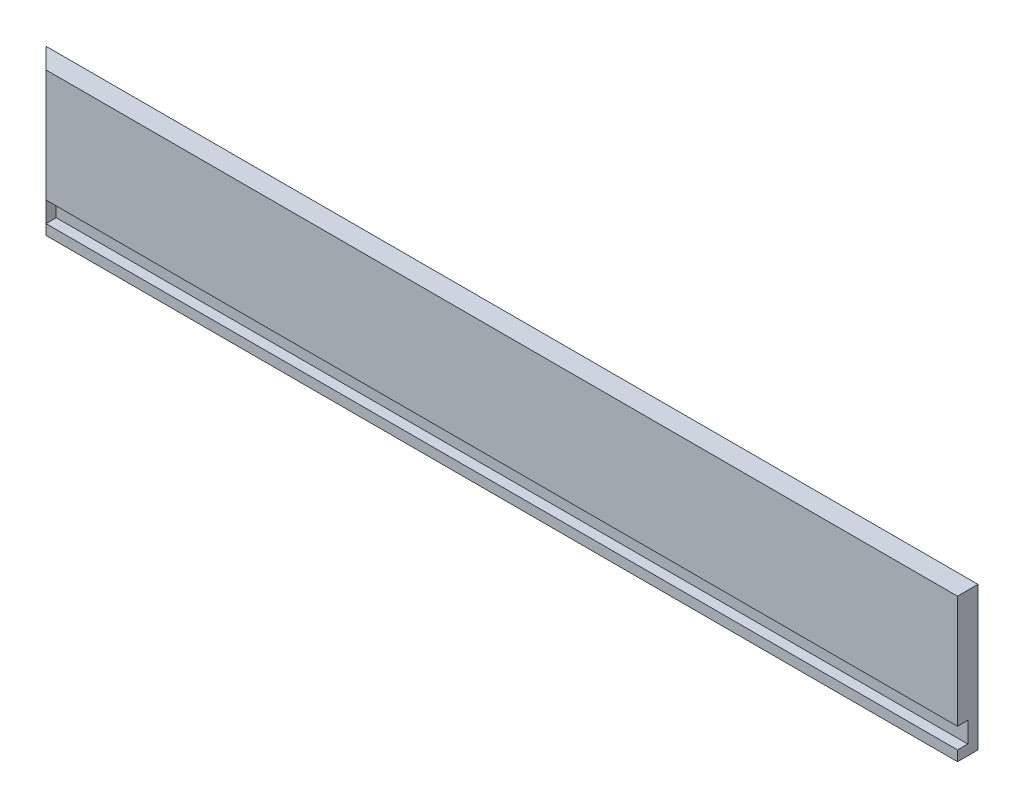
ISO-10303-21;
HEADER;
FILE_DESCRIPTION(('STEP AP214'),'2;1');
FILE_NAME('part.step','',(''),(''),'','','');
FILE_SCHEMA(('AUTOMOTIVE_DESIGN { 1 0 10303 214 1 1 1 1 }'));
ENDSEC;
DATA;
#1=APPLICATION_CONTEXT('core data for automotive mechanical design processes');
#2=APPLICATION_PROTOCOL_DEFINITION('international standard','automotive_design',2000,#1);
#3=PRODUCT_CONTEXT('',#1,'mechanical');
#4=PRODUCT('Part','Part','',(#3));
#5=PRODUCT_RELATED_PRODUCT_CATEGORY('part','',(#4));
#6=PRODUCT_DEFINITION_FORMATION('','',#4);
#7=PRODUCT_DEFINITION_CONTEXT('part definition',#1,'design');
#8=PRODUCT_DEFINITION('design','',#6,#7);
#9=PRODUCT_DEFINITION_SHAPE('','',#8);
#10=(LENGTH_UNIT() NAMED_UNIT(*) SI_UNIT(.MILLI.,.METRE.));
#11=(NAMED_UNIT(*) PLANE_ANGLE_UNIT() SI_UNIT($,.RADIAN.));
#12=(NAMED_UNIT(*) SI_UNIT($,.STERADIAN.) SOLID_ANGLE_UNIT());
#13=UNCERTAINTY_MEASURE_WITH_UNIT(LENGTH_MEASURE(1.E-05),#10,'distance_accuracy_value','');
#14=(GEOMETRIC_REPRESENTATION_CONTEXT(3) GLOBAL_UNCERTAINTY_ASSIGNED_CONTEXT((#13)) GLOBAL_UNIT_ASSIGNED_CONTEXT((#10,
#11,#12)) REPRESENTATION_CONTEXT('',''));
#15=CARTESIAN_POINT('',(0.,0.,0.));
#16=DIRECTION('',(0.,0.,1.));
#17=DIRECTION('',(1.,0.,0.));
#18=AXIS2_PLACEMENT_3D('',#15,#16,#17);
#19=CARTESIAN_POINT('',(0.,0.,12.7));
#20=DIRECTION('',(0.,0.,1.));
#21=DIRECTION('',(1.,0.,0.));
#22=AXIS2_PLACEMENT_3D('',#19,#20,#21);
#23=PLANE('',#22);
#24=DIRECTION('',(-1.,0.,0.));
#25=VECTOR('',#24,1.);
#26=CARTESIAN_POINT('',(-200.944003606853,49.2826420198376,12.7));
#27=LINE('',#26,#25);
#28=CARTESIAN_POINT('',(364.205996393147,49.2826420198376,12.7));
#29=VERTEX_POINT('',#28);
#30=CARTESIAN_POINT('',(-200.944003606853,49.2826420198376,12.7));
#31=VERTEX_POINT('',#30);
#32=EDGE_CURVE('E57',#29,#31,#27,.T.);
#33=ORIENTED_EDGE('',*,*,#32,.F.);
#34=DIRECTION('',(0.,1.,0.));
#35=VECTOR('',#34,1.);
#36=CARTESIAN_POINT('',(364.205996393147,119.132642019838,12.7));
#37=LINE('',#36,#35);
#38=CARTESIAN_POINT('',(364.205996393147,119.132642019838,12.7));
#39=VERTEX_POINT('',#38);
#40=EDGE_CURVE('E65',#29,#39,#37,.T.);
#41=ORIENTED_EDGE('',*,*,#40,.T.);
#42=DIRECTION('',(-1.,0.,0.));
#43=VECTOR('',#42,1.);
#44=CARTESIAN_POINT('',(-213.644003606853,119.132642019838,12.7));
#45=LINE('',#44,#43);
#46=CARTESIAN_POINT('',(-200.944003606853,119.132642019838,12.7));
#47=VERTEX_POINT('',#46);
#48=EDGE_CURVE('E122',#39,#47,#45,.T.);
#49=ORIENTED_EDGE('',*,*,#48,.T.);
#50=DIRECTION('',(0.,1.,0.));
#51=VECTOR('',#50,1.);
#52=CARTESIAN_POINT('',(-200.944003606853,30.2326420198376,12.7));
#53=LINE('',#52,#51);
#54=EDGE_CURVE('E93',#31,#47,#53,.T.);
#55=ORIENTED_EDGE('',*,*,#54,.F.);
#56=EDGE_LOOP('',(#33,#41,#49,#55));
#57=FACE_BOUND('',#56,.T.);
#58=ADVANCED_FACE('F41',(#57),#23,.T.);
#59=CARTESIAN_POINT('',(-213.644003606853,30.2326420198376,12.7));
#60=DIRECTION('',(0.,1.,0.));
#61=DIRECTION('',(0.,0.,1.));
#62=AXIS2_PLACEMENT_3D('',#59,#60,#61);
#63=PLANE('',#62);
#64=DIRECTION('',(1.,0.,0.));
#65=VECTOR('',#64,1.);
#66=CARTESIAN_POINT('',(-213.644003606853,30.2326420198376,12.7));
#67=LINE('',#66,#65);
#68=CARTESIAN_POINT('',(-200.944003606853,30.2326420198376,12.7));
#69=VERTEX_POINT('',#68);
#70=CARTESIAN_POINT('',(364.205996393147,30.2326420198376,12.7));
#71=VERTEX_POINT('',#70);
#72=EDGE_CURVE('E107',#69,#71,#67,.T.);
#73=ORIENTED_EDGE('',*,*,#72,.F.);
#74=DIRECTION('',(-0.707106781186542,0.,-0.707106781186552));
#75=VECTOR('',#74,1.);
#76=CARTESIAN_POINT('',(-200.944003606853,30.2326420198376,12.7));
#77=LINE('',#76,#75);
#78=CARTESIAN_POINT('',(-213.644003606853,30.2326420198376,0.));
#79=VERTEX_POINT('',#78);
#80=EDGE_CURVE('E97',#69,#79,#77,.T.);
#81=ORIENTED_EDGE('',*,*,#80,.T.);
#82=DIRECTION('',(1.,0.,0.));
#83=VECTOR('',#82,1.);
#84=CARTESIAN_POINT('',(-213.644003606853,30.2326420198376,0.));
#85=LINE('',#84,#83);
#86=CARTESIAN_POINT('',(364.205996393147,30.2326420198376,0.));
#87=VERTEX_POINT('',#86);
#88=EDGE_CURVE('E112',#79,#87,#85,.T.);
#89=ORIENTED_EDGE('',*,*,#88,.T.);
#90=DIRECTION('',(0.,0.,-1.));
#91=VECTOR('',#90,1.);
#92=CARTESIAN_POINT('',(364.205996393147,30.2326420198376,12.7));
#93=LINE('',#92,#91);
#94=EDGE_CURVE('E11',#71,#87,#93,.T.);
#95=ORIENTED_EDGE('',*,*,#94,.F.);
#96=EDGE_LOOP('',(#73,#81,#89,#95));
#97=FACE_BOUND('',#96,.T.);
#98=ADVANCED_FACE('F43',(#97),#63,.F.);
#99=CARTESIAN_POINT('',(364.205996393147,119.132642019838,12.7));
#100=DIRECTION('',(-1.,0.,0.));
#101=DIRECTION('',(0.,0.,1.));
#102=AXIS2_PLACEMENT_3D('',#99,#100,#101);
#103=PLANE('',#102);
#104=ORIENTED_EDGE('',*,*,#40,.F.);
#105=DIRECTION('',(0.,0.,1.));
#106=VECTOR('',#105,1.);
#107=CARTESIAN_POINT('',(364.205996393147,49.2826420198376,6.35));
#108=LINE('',#107,#106);
#109=CARTESIAN_POINT('',(364.205996393147,49.2826420198376,6.35));
#110=VERTEX_POINT('',#109);
#111=EDGE_CURVE('E150',#110,#29,#108,.T.);
#112=ORIENTED_EDGE('',*,*,#111,.F.);
#113=DIRECTION('',(0.,1.,0.));
#114=VECTOR('',#113,1.);
#115=CARTESIAN_POINT('',(364.205996393147,49.2826420198376,6.35));
#116=LINE('',#115,#114);
#117=CARTESIAN_POINT('',(364.205996393147,36.5826420198376,6.35));
#118=VERTEX_POINT('',#117);
#119=EDGE_CURVE('E169',#118,#110,#116,.T.);
#120=ORIENTED_EDGE('',*,*,#119,.F.);
#121=DIRECTION('',(0.,0.,1.));
#122=VECTOR('',#121,1.);
#123=CARTESIAN_POINT('',(364.205996393147,36.5826420198376,6.35));
#124=LINE('',#123,#122);
#125=CARTESIAN_POINT('',(364.205996393147,36.5826420198376,12.7));
#126=VERTEX_POINT('',#125);
#127=EDGE_CURVE('E145',#118,#126,#124,.T.);
#128=ORIENTED_EDGE('',*,*,#127,.T.);
#129=EDGE_CURVE('E128',#71,#126,#37,.T.);
#130=ORIENTED_EDGE('',*,*,#129,.F.);
#131=ORIENTED_EDGE('',*,*,#94,.T.);
#132=DIRECTION('',(0.,1.,0.));
#133=VECTOR('',#132,1.);
#134=CARTESIAN_POINT('',(364.205996393147,119.132642019838,0.));
#135=LINE('',#134,#133);
#136=CARTESIAN_POINT('',(364.205996393147,119.132642019838,0.));
#137=VERTEX_POINT('',#136);
#138=EDGE_CURVE('E108',#87,#137,#135,.T.);
#139=ORIENTED_EDGE('',*,*,#138,.T.);
#140=DIRECTION('',(0.,0.,-1.));
#141=VECTOR('',#140,1.);
#142=CARTESIAN_POINT('',(364.205996393147,119.132642019838,12.7));
#143=LINE('',#142,#141);
#144=EDGE_CURVE('E50',#39,#137,#143,.T.);
#145=ORIENTED_EDGE('',*,*,#144,.F.);
#146=EDGE_LOOP('',(#104,#112,#120,#128,#130,#131,#139,#145));
#147=FACE_BOUND('',#146,.T.);
#148=ADVANCED_FACE('F210',(#147),#103,.F.);
#149=CARTESIAN_POINT('',(-213.644003606853,119.132642019838,12.7));
#150=DIRECTION('',(0.,-1.,0.));
#151=DIRECTION('',(0.,0.,-1.));
#152=AXIS2_PLACEMENT_3D('',#149,#150,#151);
#153=PLANE('',#152);
#154=DIRECTION('',(-1.,0.,0.));
#155=VECTOR('',#154,1.);
#156=CARTESIAN_POINT('',(-213.644003606853,119.132642019838,0.));
#157=LINE('',#156,#155);
#158=CARTESIAN_POINT('',(-213.644003606853,119.132642019838,0.));
#159=VERTEX_POINT('',#158);
#160=EDGE_CURVE('E102',#137,#159,#157,.T.);
#161=ORIENTED_EDGE('',*,*,#160,.T.);
#162=DIRECTION('',(-0.707106781186542,0.,-0.707106781186552));
#163=VECTOR('',#162,1.);
#164=CARTESIAN_POINT('',(-200.944003606853,119.132642019838,12.7));
#165=LINE('',#164,#163);
#166=EDGE_CURVE('E83',#47,#159,#165,.T.);
#167=ORIENTED_EDGE('',*,*,#166,.F.);
#168=ORIENTED_EDGE('',*,*,#48,.F.);
#169=ORIENTED_EDGE('',*,*,#144,.T.);
#170=EDGE_LOOP('',(#161,#167,#168,#169));
#171=FACE_BOUND('',#170,.T.);
#172=ADVANCED_FACE('F103',(#171),#153,.F.);
#173=DIRECTION('',(1.,0.,0.));
#174=VECTOR('',#173,1.);
#175=CARTESIAN_POINT('',(-200.944003606853,36.5826420198376,12.7));
#176=LINE('',#175,#174);
#177=CARTESIAN_POINT('',(-200.944003606853,36.5826420198376,12.7));
#178=VERTEX_POINT('',#177);
#179=EDGE_CURVE('E158',#178,#126,#176,.T.);
#180=ORIENTED_EDGE('',*,*,#179,.F.);
#181=EDGE_CURVE('E114',#69,#178,#53,.T.);
#182=ORIENTED_EDGE('',*,*,#181,.F.);
#183=ORIENTED_EDGE('',*,*,#72,.T.);
#184=ORIENTED_EDGE('',*,*,#129,.T.);
#185=EDGE_LOOP('',(#180,#182,#183,#184));
#186=FACE_BOUND('',#185,.T.);
#187=ADVANCED_FACE('F207',(#186),#23,.T.);
#188=CARTESIAN_POINT('',(0.,0.,0.));
#189=DIRECTION('',(0.,0.,1.));
#190=DIRECTION('',(1.,0.,0.));
#191=AXIS2_PLACEMENT_3D('',#188,#189,#190);
#192=PLANE('',#191);
#193=DIRECTION('',(0.,-1.,0.));
#194=VECTOR('',#193,1.);
#195=CARTESIAN_POINT('',(-213.644003606853,119.132642019838,0.));
#196=LINE('',#195,#194);
#197=EDGE_CURVE('E88',#159,#79,#196,.T.);
#198=ORIENTED_EDGE('',*,*,#197,.F.);
#199=ORIENTED_EDGE('',*,*,#160,.F.);
#200=ORIENTED_EDGE('',*,*,#138,.F.);
#201=ORIENTED_EDGE('',*,*,#88,.F.);
#202=EDGE_LOOP('',(#198,#199,#200,#201));
#203=FACE_BOUND('',#202,.T.);
#204=ADVANCED_FACE('F111',(#203),#192,.F.);
#205=CARTESIAN_POINT('',(-200.944003606853,30.2326420198376,12.7));
#206=DIRECTION('',(0.707106781186552,0.,-0.707106781186543));
#207=DIRECTION('',(-0.707106781186543,0.,-0.707106781186552));
#208=AXIS2_PLACEMENT_3D('',#205,#206,#207);
#209=PLANE('',#208);
#210=ORIENTED_EDGE('',*,*,#166,.T.);
#211=ORIENTED_EDGE('',*,*,#197,.T.);
#212=ORIENTED_EDGE('',*,*,#80,.F.);
#213=ORIENTED_EDGE('',*,*,#181,.T.);
#214=DIRECTION('',(0.,-1.,0.));
#215=VECTOR('',#214,1.);
#216=CARTESIAN_POINT('',(-200.944003606853,49.2826420198376,12.7));
#217=LINE('',#216,#215);
#218=EDGE_CURVE('E162',#31,#178,#217,.T.);
#219=ORIENTED_EDGE('',*,*,#218,.F.);
#220=ORIENTED_EDGE('',*,*,#54,.T.);
#221=EDGE_LOOP('',(#210,#211,#212,#213,#219,#220));
#222=FACE_BOUND('',#221,.T.);
#223=ADVANCED_FACE('F85',(#222),#209,.F.);
#224=CARTESIAN_POINT('',(-200.944003606853,49.2826420198376,6.35));
#225=DIRECTION('',(-1.,0.,0.));
#226=DIRECTION('',(0.,0.,1.));
#227=AXIS2_PLACEMENT_3D('',#224,#225,#226);
#228=PLANE('',#227);
#229=ORIENTED_EDGE('',*,*,#218,.T.);
#230=DIRECTION('',(0.,0.,1.));
#231=VECTOR('',#230,1.);
#232=CARTESIAN_POINT('',(-200.944003606853,36.5826420198376,6.35));
#233=LINE('',#232,#231);
#234=CARTESIAN_POINT('',(-200.944003606853,36.5826420198376,6.35));
#235=VERTEX_POINT('',#234);
#236=EDGE_CURVE('E141',#235,#178,#233,.T.);
#237=ORIENTED_EDGE('',*,*,#236,.F.);
#238=DIRECTION('',(0.,-1.,0.));
#239=VECTOR('',#238,1.);
#240=CARTESIAN_POINT('',(-200.944003606853,49.2826420198376,6.35));
#241=LINE('',#240,#239);
#242=CARTESIAN_POINT('',(-200.944003606853,49.2826420198376,6.35));
#243=VERTEX_POINT('',#242);
#244=EDGE_CURVE('E157',#243,#235,#241,.T.);
#245=ORIENTED_EDGE('',*,*,#244,.F.);
#246=DIRECTION('',(0.,0.,1.));
#247=VECTOR('',#246,1.);
#248=CARTESIAN_POINT('',(-200.944003606853,49.2826420198376,6.35));
#249=LINE('',#248,#247);
#250=EDGE_CURVE('E98',#243,#31,#249,.T.);
#251=ORIENTED_EDGE('',*,*,#250,.T.);
#252=EDGE_LOOP('',(#229,#237,#245,#251));
#253=FACE_BOUND('',#252,.T.);
#254=ADVANCED_FACE('F192',(#253),#228,.F.);
#255=CARTESIAN_POINT('',(-200.944003606853,49.2826420198376,6.35));
#256=DIRECTION('',(0.,1.,0.));
#257=DIRECTION('',(0.,0.,1.));
#258=AXIS2_PLACEMENT_3D('',#255,#256,#257);
#259=PLANE('',#258);
#260=ORIENTED_EDGE('',*,*,#32,.T.);
#261=ORIENTED_EDGE('',*,*,#250,.F.);
#262=DIRECTION('',(-1.,0.,0.));
#263=VECTOR('',#262,1.);
#264=CARTESIAN_POINT('',(-200.944003606853,49.2826420198376,6.35));
#265=LINE('',#264,#263);
#266=EDGE_CURVE('E146',#110,#243,#265,.T.);
#267=ORIENTED_EDGE('',*,*,#266,.F.);
#268=ORIENTED_EDGE('',*,*,#111,.T.);
#269=EDGE_LOOP('',(#260,#261,#267,#268));
#270=FACE_BOUND('',#269,.T.);
#271=ADVANCED_FACE('F216',(#270),#259,.F.);
#272=CARTESIAN_POINT('',(-200.944003606853,36.5826420198376,6.35));
#273=DIRECTION('',(0.,-1.,0.));
#274=DIRECTION('',(1.,0.,0.));
#275=AXIS2_PLACEMENT_3D('',#272,#273,#274);
#276=PLANE('',#275);
#277=ORIENTED_EDGE('',*,*,#179,.T.);
#278=ORIENTED_EDGE('',*,*,#127,.F.);
#279=DIRECTION('',(1.,0.,0.));
#280=VECTOR('',#279,1.);
#281=CARTESIAN_POINT('',(-200.944003606853,36.5826420198376,6.35));
#282=LINE('',#281,#280);
#283=EDGE_CURVE('E173',#235,#118,#282,.T.);
#284=ORIENTED_EDGE('',*,*,#283,.F.);
#285=ORIENTED_EDGE('',*,*,#236,.T.);
#286=EDGE_LOOP('',(#277,#278,#284,#285));
#287=FACE_BOUND('',#286,.T.);
#288=ADVANCED_FACE('F214',(#287),#276,.F.);
#289=CARTESIAN_POINT('',(0.,0.,6.35));
#290=DIRECTION('',(0.,0.,1.));
#291=DIRECTION('',(1.,0.,0.));
#292=AXIS2_PLACEMENT_3D('',#289,#290,#291);
#293=PLANE('',#292);
#294=ORIENTED_EDGE('',*,*,#244,.T.);
#295=ORIENTED_EDGE('',*,*,#283,.T.);
#296=ORIENTED_EDGE('',*,*,#119,.T.);
#297=ORIENTED_EDGE('',*,*,#266,.T.);
#298=EDGE_LOOP('',(#294,#295,#296,#297));
#299=FACE_BOUND('',#298,.T.);
#300=ADVANCED_FACE('F182',(#299),#293,.T.);
#301=CLOSED_SHELL('',(#58,#98,#148,#172,#187,#204,#223,#254,#271,#288,#300));
#302=MANIFOLD_SOLID_BREP('B2',#301);
#303=ADVANCED_BREP_SHAPE_REPRESENTATION('',(#18,#302),#14);
#304=SHAPE_DEFINITION_REPRESENTATION(#9,#303);
ENDSEC;
END-ISO-10303-21;
